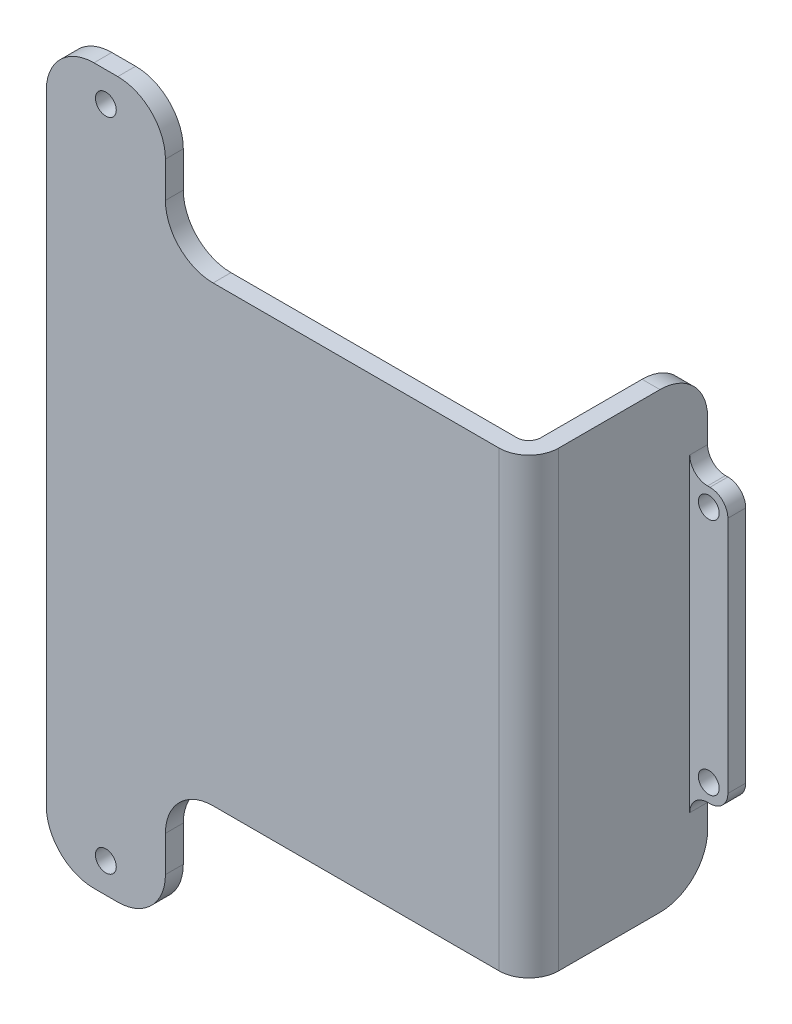
ISO-10303-21;
HEADER;
FILE_DESCRIPTION(('STEP AP214'),'2;1');
FILE_NAME('part.step','',(''),(''),'','','');
FILE_SCHEMA(('AUTOMOTIVE_DESIGN { 1 0 10303 214 1 1 1 1 }'));
ENDSEC;
DATA;
#1=APPLICATION_CONTEXT('core data for automotive mechanical design processes');
#2=APPLICATION_PROTOCOL_DEFINITION('international standard','automotive_design',2000,#1);
#3=PRODUCT_CONTEXT('',#1,'mechanical');
#4=PRODUCT('Part','Part','',(#3));
#5=PRODUCT_RELATED_PRODUCT_CATEGORY('part','',(#4));
#6=PRODUCT_DEFINITION_FORMATION('','',#4);
#7=PRODUCT_DEFINITION_CONTEXT('part definition',#1,'design');
#8=PRODUCT_DEFINITION('design','',#6,#7);
#9=PRODUCT_DEFINITION_SHAPE('','',#8);
#10=(LENGTH_UNIT() NAMED_UNIT(*) SI_UNIT(.MILLI.,.METRE.));
#11=(NAMED_UNIT(*) PLANE_ANGLE_UNIT() SI_UNIT($,.RADIAN.));
#12=(NAMED_UNIT(*) SI_UNIT($,.STERADIAN.) SOLID_ANGLE_UNIT());
#13=UNCERTAINTY_MEASURE_WITH_UNIT(LENGTH_MEASURE(1.E-05),#10,'distance_accuracy_value','');
#14=(GEOMETRIC_REPRESENTATION_CONTEXT(3) GLOBAL_UNCERTAINTY_ASSIGNED_CONTEXT((#13)) GLOBAL_UNIT_ASSIGNED_CONTEXT((#10,
#11,#12)) REPRESENTATION_CONTEXT('',''));
#15=CARTESIAN_POINT('',(0.,0.,0.));
#16=DIRECTION('',(0.,0.,1.));
#17=DIRECTION('',(1.,0.,0.));
#18=AXIS2_PLACEMENT_3D('',#15,#16,#17);
#19=CARTESIAN_POINT('',(0.,23.,-27.));
#20=DIRECTION('',(0.,1.,0.));
#21=DIRECTION('',(0.,0.,1.));
#22=AXIS2_PLACEMENT_3D('',#19,#20,#21);
#23=PLANE('',#22);
#24=DIRECTION('',(-1.,0.,0.));
#25=VECTOR('',#24,1.);
#26=CARTESIAN_POINT('',(0.,23.,-27.));
#27=LINE('',#26,#25);
#28=CARTESIAN_POINT('',(33.9,23.,-27.));
#29=VERTEX_POINT('',#28);
#30=CARTESIAN_POINT('',(33.5,23.,-27.));
#31=VERTEX_POINT('',#30);
#32=EDGE_CURVE('E253',#29,#31,#27,.T.);
#33=ORIENTED_EDGE('',*,*,#32,.T.);
#34=DIRECTION('',(0.,0.,1.));
#35=VECTOR('',#34,1.);
#36=CARTESIAN_POINT('',(33.5,23.,-24.));
#37=LINE('',#36,#35);
#38=CARTESIAN_POINT('',(33.5,23.,-24.));
#39=VERTEX_POINT('',#38);
#40=EDGE_CURVE('E410',#31,#39,#37,.T.);
#41=ORIENTED_EDGE('',*,*,#40,.T.);
#42=DIRECTION('',(-1.,0.,0.));
#43=VECTOR('',#42,1.);
#44=CARTESIAN_POINT('',(0.,23.,-24.));
#45=LINE('',#44,#43);
#46=CARTESIAN_POINT('',(33.9,23.,-24.));
#47=VERTEX_POINT('',#46);
#48=EDGE_CURVE('E279',#47,#39,#45,.T.);
#49=ORIENTED_EDGE('',*,*,#48,.F.);
#50=DIRECTION('',(0.,0.,1.));
#51=VECTOR('',#50,1.);
#52=CARTESIAN_POINT('',(33.9,23.,-27.));
#53=LINE('',#52,#51);
#54=EDGE_CURVE('E408',#47,#29,#53,.F.);
#55=ORIENTED_EDGE('',*,*,#54,.T.);
#56=EDGE_LOOP('',(#33,#41,#49,#55));
#57=FACE_BOUND('',#56,.T.);
#58=ADVANCED_FACE('F39',(#57),#23,.T.);
#59=CARTESIAN_POINT('',(36.9,0.,-27.));
#60=DIRECTION('',(-1.,0.,0.));
#61=DIRECTION('',(0.,0.,1.));
#62=AXIS2_PLACEMENT_3D('',#59,#60,#61);
#63=PLANE('',#62);
#64=DIRECTION('',(0.,-1.,0.));
#65=VECTOR('',#64,1.);
#66=CARTESIAN_POINT('',(36.9,0.,-27.));
#67=LINE('',#66,#65);
#68=CARTESIAN_POINT('',(36.9,20.,-27.));
#69=VERTEX_POINT('',#68);
#70=CARTESIAN_POINT('',(36.9,-20.,-27.));
#71=VERTEX_POINT('',#70);
#72=EDGE_CURVE('E260',#69,#71,#67,.T.);
#73=ORIENTED_EDGE('',*,*,#72,.F.);
#74=DIRECTION('',(0.,0.,1.));
#75=VECTOR('',#74,1.);
#76=CARTESIAN_POINT('',(36.9,20.,-24.));
#77=LINE('',#76,#75);
#78=CARTESIAN_POINT('',(36.9,20.,-24.));
#79=VERTEX_POINT('',#78);
#80=EDGE_CURVE('E418',#69,#79,#77,.T.);
#81=ORIENTED_EDGE('',*,*,#80,.T.);
#82=DIRECTION('',(0.,-1.,0.));
#83=VECTOR('',#82,1.);
#84=CARTESIAN_POINT('',(36.9,0.,-24.));
#85=LINE('',#84,#83);
#86=CARTESIAN_POINT('',(36.9,-20.,-24.));
#87=VERTEX_POINT('',#86);
#88=EDGE_CURVE('E282',#79,#87,#85,.T.);
#89=ORIENTED_EDGE('',*,*,#88,.T.);
#90=DIRECTION('',(0.,0.,1.));
#91=VECTOR('',#90,1.);
#92=CARTESIAN_POINT('',(36.9,-20.,-27.));
#93=LINE('',#92,#91);
#94=EDGE_CURVE('E416',#87,#71,#93,.F.);
#95=ORIENTED_EDGE('',*,*,#94,.T.);
#96=EDGE_LOOP('',(#73,#81,#89,#95));
#97=FACE_BOUND('',#96,.T.);
#98=ADVANCED_FACE('F434',(#97),#63,.F.);
#99=CARTESIAN_POINT('',(0.,-23.,-27.));
#100=DIRECTION('',(0.,1.,0.));
#101=DIRECTION('',(0.,0.,1.));
#102=AXIS2_PLACEMENT_3D('',#99,#100,#101);
#103=PLANE('',#102);
#104=DIRECTION('',(-1.,0.,0.));
#105=VECTOR('',#104,1.);
#106=CARTESIAN_POINT('',(0.,-23.,-27.));
#107=LINE('',#106,#105);
#108=CARTESIAN_POINT('',(33.9,-23.,-27.));
#109=VERTEX_POINT('',#108);
#110=CARTESIAN_POINT('',(33.5,-23.,-27.));
#111=VERTEX_POINT('',#110);
#112=EDGE_CURVE('E264',#109,#111,#107,.T.);
#113=ORIENTED_EDGE('',*,*,#112,.F.);
#114=DIRECTION('',(0.,0.,1.));
#115=VECTOR('',#114,1.);
#116=CARTESIAN_POINT('',(33.9,-23.,-27.));
#117=LINE('',#116,#115);
#118=CARTESIAN_POINT('',(33.9,-23.,-24.));
#119=VERTEX_POINT('',#118);
#120=EDGE_CURVE('E295',#109,#119,#117,.T.);
#121=ORIENTED_EDGE('',*,*,#120,.T.);
#122=DIRECTION('',(-1.,0.,0.));
#123=VECTOR('',#122,1.);
#124=CARTESIAN_POINT('',(0.,-23.,-24.));
#125=LINE('',#124,#123);
#126=CARTESIAN_POINT('',(33.5,-23.,-24.));
#127=VERTEX_POINT('',#126);
#128=EDGE_CURVE('E285',#119,#127,#125,.T.);
#129=ORIENTED_EDGE('',*,*,#128,.T.);
#130=DIRECTION('',(0.,0.,1.));
#131=VECTOR('',#130,1.);
#132=CARTESIAN_POINT('',(33.5,-23.,-27.));
#133=LINE('',#132,#131);
#134=EDGE_CURVE('E293',#127,#111,#133,.F.);
#135=ORIENTED_EDGE('',*,*,#134,.T.);
#136=EDGE_LOOP('',(#113,#121,#129,#135));
#137=FACE_BOUND('',#136,.T.);
#138=ADVANCED_FACE('F292',(#137),#103,.F.);
#139=CARTESIAN_POINT('',(33.7,20.,-27.));
#140=DIRECTION('',(0.,0.,1.));
#141=DIRECTION('',(1.,0.,0.));
#142=AXIS2_PLACEMENT_3D('',#139,#140,#141);
#143=CYLINDRICAL_SURFACE('',#142,1.75);
#144=CARTESIAN_POINT('',(33.7,20.,-27.));
#145=DIRECTION('',(0.,0.,1.));
#146=DIRECTION('',(1.,0.,0.));
#147=AXIS2_PLACEMENT_3D('',#144,#145,#146);
#148=CIRCLE('',#147,1.75);
#149=CARTESIAN_POINT('',(35.45,20.,-27.));
#150=VERTEX_POINT('',#149);
#151=EDGE_CURVE('E252',#150,#150,#148,.T.);
#152=ORIENTED_EDGE('',*,*,#151,.F.);
#153=EDGE_LOOP('',(#152));
#154=FACE_BOUND('',#153,.T.);
#155=CARTESIAN_POINT('',(33.7,20.,-24.));
#156=DIRECTION('',(0.,0.,1.));
#157=DIRECTION('',(1.,0.,0.));
#158=AXIS2_PLACEMENT_3D('',#155,#156,#157);
#159=CIRCLE('',#158,1.75);
#160=CARTESIAN_POINT('',(35.45,20.,-24.));
#161=VERTEX_POINT('',#160);
#162=EDGE_CURVE('E272',#161,#161,#159,.T.);
#163=ORIENTED_EDGE('',*,*,#162,.T.);
#164=EDGE_LOOP('',(#163));
#165=FACE_BOUND('',#164,.T.);
#166=ADVANCED_FACE('F527',(#154,#165),#143,.F.);
#167=CARTESIAN_POINT('',(33.7,-20.,-27.));
#168=DIRECTION('',(0.,0.,1.));
#169=DIRECTION('',(1.,0.,0.));
#170=AXIS2_PLACEMENT_3D('',#167,#168,#169);
#171=CYLINDRICAL_SURFACE('',#170,1.75);
#172=CARTESIAN_POINT('',(33.7,-20.,-27.));
#173=DIRECTION('',(0.,0.,1.));
#174=DIRECTION('',(1.,0.,0.));
#175=AXIS2_PLACEMENT_3D('',#172,#173,#174);
#176=CIRCLE('',#175,1.75);
#177=CARTESIAN_POINT('',(35.45,-20.,-27.));
#178=VERTEX_POINT('',#177);
#179=EDGE_CURVE('E257',#178,#178,#176,.F.);
#180=ORIENTED_EDGE('',*,*,#179,.T.);
#181=EDGE_LOOP('',(#180));
#182=FACE_BOUND('',#181,.T.);
#183=CARTESIAN_POINT('',(33.7,-20.,-24.));
#184=DIRECTION('',(0.,0.,1.));
#185=DIRECTION('',(1.,0.,0.));
#186=AXIS2_PLACEMENT_3D('',#183,#184,#185);
#187=CIRCLE('',#186,1.75);
#188=CARTESIAN_POINT('',(35.45,-20.,-24.));
#189=VERTEX_POINT('',#188);
#190=EDGE_CURVE('E268',#189,#189,#187,.F.);
#191=ORIENTED_EDGE('',*,*,#190,.F.);
#192=EDGE_LOOP('',(#191));
#193=FACE_BOUND('',#192,.T.);
#194=ADVANCED_FACE('F534',(#182,#193),#171,.F.);
#195=CARTESIAN_POINT('',(0.,-60.,3.));
#196=DIRECTION('',(0.,1.,0.));
#197=DIRECTION('',(0.,0.,1.));
#198=AXIS2_PLACEMENT_3D('',#195,#196,#197);
#199=PLANE('',#198);
#200=DIRECTION('',(1.,0.,0.));
#201=VECTOR('',#200,1.);
#202=CARTESIAN_POINT('',(0.,-60.,3.));
#203=LINE('',#202,#201);
#204=CARTESIAN_POINT('',(-42.5,-60.,3.));
#205=VERTEX_POINT('',#204);
#206=CARTESIAN_POINT('',(-38.5,-60.,3.));
#207=VERTEX_POINT('',#206);
#208=EDGE_CURVE('E463',#205,#207,#203,.T.);
#209=ORIENTED_EDGE('',*,*,#208,.F.);
#210=DIRECTION('',(0.,0.,-1.));
#211=VECTOR('',#210,1.);
#212=CARTESIAN_POINT('',(-42.5,-60.,3.));
#213=LINE('',#212,#211);
#214=CARTESIAN_POINT('',(-42.5,-60.,0.));
#215=VERTEX_POINT('',#214);
#216=EDGE_CURVE('E397',#205,#215,#213,.T.);
#217=ORIENTED_EDGE('',*,*,#216,.T.);
#218=DIRECTION('',(1.,0.,0.));
#219=VECTOR('',#218,1.);
#220=CARTESIAN_POINT('',(0.,-60.,0.));
#221=LINE('',#220,#219);
#222=CARTESIAN_POINT('',(-38.5,-60.,0.));
#223=VERTEX_POINT('',#222);
#224=EDGE_CURVE('E453',#215,#223,#221,.T.);
#225=ORIENTED_EDGE('',*,*,#224,.T.);
#226=DIRECTION('',(0.,0.,-1.));
#227=VECTOR('',#226,1.);
#228=CARTESIAN_POINT('',(-38.5,-60.,3.));
#229=LINE('',#228,#227);
#230=EDGE_CURVE('E395',#223,#207,#229,.F.);
#231=ORIENTED_EDGE('',*,*,#230,.T.);
#232=EDGE_LOOP('',(#209,#217,#225,#231));
#233=FACE_BOUND('',#232,.T.);
#234=ADVANCED_FACE('F539',(#233),#199,.F.);
#235=CARTESIAN_POINT('',(-30.5,0.,3.));
#236=DIRECTION('',(-1.,0.,0.));
#237=DIRECTION('',(0.,-1.,0.));
#238=AXIS2_PLACEMENT_3D('',#235,#236,#237);
#239=PLANE('',#238);
#240=DIRECTION('',(0.,1.,0.));
#241=VECTOR('',#240,1.);
#242=CARTESIAN_POINT('',(-30.5,0.,0.));
#243=LINE('',#242,#241);
#244=CARTESIAN_POINT('',(-30.5,-52.,0.));
#245=VERTEX_POINT('',#244);
#246=CARTESIAN_POINT('',(-30.5,-46.,0.));
#247=VERTEX_POINT('',#246);
#248=EDGE_CURVE('E457',#245,#247,#243,.T.);
#249=ORIENTED_EDGE('',*,*,#248,.T.);
#250=DIRECTION('',(0.,0.,-1.));
#251=VECTOR('',#250,1.);
#252=CARTESIAN_POINT('',(-30.5,-46.,3.));
#253=LINE('',#252,#251);
#254=CARTESIAN_POINT('',(-30.5,-46.,3.));
#255=VERTEX_POINT('',#254);
#256=EDGE_CURVE('E393',#247,#255,#253,.F.);
#257=ORIENTED_EDGE('',*,*,#256,.T.);
#258=DIRECTION('',(0.,1.,0.));
#259=VECTOR('',#258,1.);
#260=CARTESIAN_POINT('',(-30.5,0.,3.));
#261=LINE('',#260,#259);
#262=CARTESIAN_POINT('',(-30.5,-52.,3.));
#263=VERTEX_POINT('',#262);
#264=EDGE_CURVE('E466',#263,#255,#261,.T.);
#265=ORIENTED_EDGE('',*,*,#264,.F.);
#266=DIRECTION('',(0.,0.,-1.));
#267=VECTOR('',#266,1.);
#268=CARTESIAN_POINT('',(-30.5,-52.,3.));
#269=LINE('',#268,#267);
#270=EDGE_CURVE('E390',#263,#245,#269,.T.);
#271=ORIENTED_EDGE('',*,*,#270,.T.);
#272=EDGE_LOOP('',(#249,#257,#265,#271));
#273=FACE_BOUND('',#272,.T.);
#274=ADVANCED_FACE('F590',(#273),#239,.F.);
#275=CARTESIAN_POINT('',(0.,-38.,3.));
#276=DIRECTION('',(0.,1.,0.));
#277=DIRECTION('',(0.,0.,1.));
#278=AXIS2_PLACEMENT_3D('',#275,#276,#277);
#279=PLANE('',#278);
#280=DIRECTION('',(0.,0.,-1.));
#281=VECTOR('',#280,1.);
#282=CARTESIAN_POINT('',(30.5,-38.,3.));
#283=LINE('',#282,#281);
#284=CARTESIAN_POINT('',(30.5,-38.,-2.));
#285=VERTEX_POINT('',#284);
#286=CARTESIAN_POINT('',(30.5,-38.,-19.));
#287=VERTEX_POINT('',#286);
#288=EDGE_CURVE('E332',#285,#287,#283,.T.);
#289=ORIENTED_EDGE('',*,*,#288,.F.);
#290=CARTESIAN_POINT('',(25.5,-38.,-2.));
#291=DIRECTION('',(0.,1.,0.));
#292=DIRECTION('',(0.,0.,1.));
#293=AXIS2_PLACEMENT_3D('',#290,#291,#292);
#294=CIRCLE('',#293,5.);
#295=CARTESIAN_POINT('',(25.5,-38.,3.));
#296=VERTEX_POINT('',#295);
#297=EDGE_CURVE('E61',#285,#296,#294,.F.);
#298=ORIENTED_EDGE('',*,*,#297,.T.);
#299=DIRECTION('',(1.,0.,0.));
#300=VECTOR('',#299,1.);
#301=CARTESIAN_POINT('',(0.,-38.,3.));
#302=LINE('',#301,#300);
#303=CARTESIAN_POINT('',(-22.5,-38.,3.));
#304=VERTEX_POINT('',#303);
#305=EDGE_CURVE('E470',#304,#296,#302,.T.);
#306=ORIENTED_EDGE('',*,*,#305,.F.);
#307=DIRECTION('',(0.,0.,-1.));
#308=VECTOR('',#307,1.);
#309=CARTESIAN_POINT('',(-22.5,-38.,0.));
#310=LINE('',#309,#308);
#311=CARTESIAN_POINT('',(-22.5,-38.,0.));
#312=VERTEX_POINT('',#311);
#313=EDGE_CURVE('E355',#304,#312,#310,.T.);
#314=ORIENTED_EDGE('',*,*,#313,.T.);
#315=DIRECTION('',(1.,0.,0.));
#316=VECTOR('',#315,1.);
#317=CARTESIAN_POINT('',(0.,-38.,0.));
#318=LINE('',#317,#316);
#319=CARTESIAN_POINT('',(25.5,-38.,0.));
#320=VERTEX_POINT('',#319);
#321=EDGE_CURVE('E488',#312,#320,#318,.T.);
#322=ORIENTED_EDGE('',*,*,#321,.T.);
#323=CARTESIAN_POINT('',(25.5,-38.,-2.));
#324=DIRECTION('',(0.,1.,0.));
#325=DIRECTION('',(0.,0.,1.));
#326=AXIS2_PLACEMENT_3D('',#323,#324,#325);
#327=CIRCLE('',#326,2.);
#328=CARTESIAN_POINT('',(27.5,-38.,-2.));
#329=VERTEX_POINT('',#328);
#330=EDGE_CURVE('E324',#320,#329,#327,.T.);
#331=ORIENTED_EDGE('',*,*,#330,.T.);
#332=DIRECTION('',(0.,0.,1.));
#333=VECTOR('',#332,1.);
#334=CARTESIAN_POINT('',(27.5,-38.,-27.));
#335=LINE('',#334,#333);
#336=CARTESIAN_POINT('',(27.5,-38.,-19.));
#337=VERTEX_POINT('',#336);
#338=EDGE_CURVE('E450',#337,#329,#335,.T.);
#339=ORIENTED_EDGE('',*,*,#338,.F.);
#340=DIRECTION('',(1.,0.,0.));
#341=VECTOR('',#340,1.);
#342=CARTESIAN_POINT('',(0.,-38.,-19.));
#343=LINE('',#342,#341);
#344=EDGE_CURVE('E341',#337,#287,#343,.T.);
#345=ORIENTED_EDGE('',*,*,#344,.T.);
#346=EDGE_LOOP('',(#289,#298,#306,#314,#322,#331,#339,#345));
#347=FACE_BOUND('',#346,.T.);
#348=ADVANCED_FACE('F338',(#347),#279,.F.);
#349=CARTESIAN_POINT('',(30.5,0.,3.));
#350=DIRECTION('',(1.,0.,0.));
#351=DIRECTION('',(0.,0.,-1.));
#352=AXIS2_PLACEMENT_3D('',#349,#350,#351);
#353=PLANE('',#352);
#354=DIRECTION('',(0.,0.,-1.));
#355=VECTOR('',#354,1.);
#356=CARTESIAN_POINT('',(30.5,38.,3.));
#357=LINE('',#356,#355);
#358=CARTESIAN_POINT('',(30.5,38.,-2.));
#359=VERTEX_POINT('',#358);
#360=CARTESIAN_POINT('',(30.5,38.,-19.));
#361=VERTEX_POINT('',#360);
#362=EDGE_CURVE('E334',#359,#361,#357,.T.);
#363=ORIENTED_EDGE('',*,*,#362,.F.);
#364=DIRECTION('',(0.,-1.,0.));
#365=VECTOR('',#364,1.);
#366=CARTESIAN_POINT('',(30.5,0.,-2.));
#367=LINE('',#366,#365);
#368=EDGE_CURVE('E328',#359,#285,#367,.T.);
#369=ORIENTED_EDGE('',*,*,#368,.T.);
#370=ORIENTED_EDGE('',*,*,#288,.T.);
#371=CARTESIAN_POINT('',(30.5,-30.,-19.));
#372=DIRECTION('',(1.,0.,0.));
#373=DIRECTION('',(0.,0.,-1.));
#374=AXIS2_PLACEMENT_3D('',#371,#372,#373);
#375=CIRCLE('',#374,8.);
#376=CARTESIAN_POINT('',(30.5,-30.,-27.));
#377=VERTEX_POINT('',#376);
#378=EDGE_CURVE('E235',#287,#377,#375,.T.);
#379=ORIENTED_EDGE('',*,*,#378,.T.);
#380=DIRECTION('',(0.,-1.,0.));
#381=VECTOR('',#380,1.);
#382=CARTESIAN_POINT('',(30.5,0.,-27.));
#383=LINE('',#382,#381);
#384=CARTESIAN_POINT('',(30.5,-26.,-27.));
#385=VERTEX_POINT('',#384);
#386=EDGE_CURVE('E255',#385,#377,#383,.T.);
#387=ORIENTED_EDGE('',*,*,#386,.F.);
#388=DIRECTION('',(0.,0.,1.));
#389=VECTOR('',#388,1.);
#390=CARTESIAN_POINT('',(30.5,-26.,3.));
#391=LINE('',#390,#389);
#392=CARTESIAN_POINT('',(30.5,-26.,-24.));
#393=VERTEX_POINT('',#392);
#394=EDGE_CURVE('E413',#385,#393,#391,.T.);
#395=ORIENTED_EDGE('',*,*,#394,.T.);
#396=DIRECTION('',(0.,-1.,0.));
#397=VECTOR('',#396,1.);
#398=CARTESIAN_POINT('',(30.5,0.,-24.));
#399=LINE('',#398,#397);
#400=CARTESIAN_POINT('',(30.5,26.,-24.));
#401=VERTEX_POINT('',#400);
#402=EDGE_CURVE('E277',#401,#393,#399,.T.);
#403=ORIENTED_EDGE('',*,*,#402,.F.);
#404=DIRECTION('',(0.,0.,1.));
#405=VECTOR('',#404,1.);
#406=CARTESIAN_POINT('',(30.5,26.,-27.));
#407=LINE('',#406,#405);
#408=CARTESIAN_POINT('',(30.5,26.,-27.));
#409=VERTEX_POINT('',#408);
#410=EDGE_CURVE('E251',#401,#409,#407,.F.);
#411=ORIENTED_EDGE('',*,*,#410,.T.);
#412=CARTESIAN_POINT('',(30.5,30.,-27.));
#413=VERTEX_POINT('',#412);
#414=EDGE_CURVE('E243',#413,#409,#383,.T.);
#415=ORIENTED_EDGE('',*,*,#414,.F.);
#416=CARTESIAN_POINT('',(30.5,30.,-19.));
#417=DIRECTION('',(1.,0.,0.));
#418=DIRECTION('',(0.,0.,-1.));
#419=AXIS2_PLACEMENT_3D('',#416,#417,#418);
#420=CIRCLE('',#419,8.);
#421=EDGE_CURVE('E225',#413,#361,#420,.T.);
#422=ORIENTED_EDGE('',*,*,#421,.T.);
#423=EDGE_LOOP('',(#363,#369,#370,#379,#387,#395,#403,#411,#415,#422));
#424=FACE_BOUND('',#423,.T.);
#425=ADVANCED_FACE('F249',(#424),#353,.T.);
#426=CARTESIAN_POINT('',(0.,38.,3.));
#427=DIRECTION('',(0.,1.,0.));
#428=DIRECTION('',(0.,0.,1.));
#429=AXIS2_PLACEMENT_3D('',#426,#427,#428);
#430=PLANE('',#429);
#431=DIRECTION('',(1.,0.,0.));
#432=VECTOR('',#431,1.);
#433=CARTESIAN_POINT('',(0.,38.,3.));
#434=LINE('',#433,#432);
#435=CARTESIAN_POINT('',(-22.4999999999999,38.,3.));
#436=VERTEX_POINT('',#435);
#437=CARTESIAN_POINT('',(25.5,38.,3.));
#438=VERTEX_POINT('',#437);
#439=EDGE_CURVE('E473',#436,#438,#434,.T.);
#440=ORIENTED_EDGE('',*,*,#439,.T.);
#441=CARTESIAN_POINT('',(25.5,38.,-2.));
#442=DIRECTION('',(0.,1.,0.));
#443=DIRECTION('',(0.,0.,1.));
#444=AXIS2_PLACEMENT_3D('',#441,#442,#443);
#445=CIRCLE('',#444,5.);
#446=EDGE_CURVE('E11',#438,#359,#445,.T.);
#447=ORIENTED_EDGE('',*,*,#446,.T.);
#448=ORIENTED_EDGE('',*,*,#362,.T.);
#449=DIRECTION('',(1.,0.,0.));
#450=VECTOR('',#449,1.);
#451=CARTESIAN_POINT('',(27.5,38.,-19.));
#452=LINE('',#451,#450);
#453=CARTESIAN_POINT('',(27.5,38.,-19.));
#454=VERTEX_POINT('',#453);
#455=EDGE_CURVE('E230',#361,#454,#452,.F.);
#456=ORIENTED_EDGE('',*,*,#455,.T.);
#457=DIRECTION('',(0.,0.,1.));
#458=VECTOR('',#457,1.);
#459=CARTESIAN_POINT('',(27.5,38.,-27.));
#460=LINE('',#459,#458);
#461=CARTESIAN_POINT('',(27.5,38.,-2.));
#462=VERTEX_POINT('',#461);
#463=EDGE_CURVE('E454',#454,#462,#460,.T.);
#464=ORIENTED_EDGE('',*,*,#463,.T.);
#465=CARTESIAN_POINT('',(25.5,38.,-2.));
#466=DIRECTION('',(0.,1.,0.));
#467=DIRECTION('',(0.,0.,1.));
#468=AXIS2_PLACEMENT_3D('',#465,#466,#467);
#469=CIRCLE('',#468,2.);
#470=CARTESIAN_POINT('',(25.5,38.,0.));
#471=VERTEX_POINT('',#470);
#472=EDGE_CURVE('E326',#462,#471,#469,.F.);
#473=ORIENTED_EDGE('',*,*,#472,.T.);
#474=DIRECTION('',(1.,0.,0.));
#475=VECTOR('',#474,1.);
#476=CARTESIAN_POINT('',(0.,38.,0.));
#477=LINE('',#476,#475);
#478=CARTESIAN_POINT('',(-22.4999999999999,38.,0.));
#479=VERTEX_POINT('',#478);
#480=EDGE_CURVE('E491',#479,#471,#477,.T.);
#481=ORIENTED_EDGE('',*,*,#480,.F.);
#482=DIRECTION('',(0.,0.,-1.));
#483=VECTOR('',#482,1.);
#484=CARTESIAN_POINT('',(-22.4999999999999,38.,3.));
#485=LINE('',#484,#483);
#486=EDGE_CURVE('E234',#479,#436,#485,.F.);
#487=ORIENTED_EDGE('',*,*,#486,.T.);
#488=EDGE_LOOP('',(#440,#447,#448,#456,#464,#473,#481,#487));
#489=FACE_BOUND('',#488,.T.);
#490=ADVANCED_FACE('F602',(#489),#430,.T.);
#491=CARTESIAN_POINT('',(-30.4999999999999,46.,3.));
#492=VERTEX_POINT('',#491);
#493=CARTESIAN_POINT('',(-30.4999999999999,52.,3.));
#494=VERTEX_POINT('',#493);
#495=EDGE_CURVE('E471',#492,#494,#261,.T.);
#496=ORIENTED_EDGE('',*,*,#495,.F.);
#497=DIRECTION('',(0.,0.,-1.));
#498=VECTOR('',#497,1.);
#499=CARTESIAN_POINT('',(-30.4999999999999,46.,3.));
#500=LINE('',#499,#498);
#501=CARTESIAN_POINT('',(-30.4999999999999,46.,0.));
#502=VERTEX_POINT('',#501);
#503=EDGE_CURVE('E361',#492,#502,#500,.T.);
#504=ORIENTED_EDGE('',*,*,#503,.T.);
#505=CARTESIAN_POINT('',(-30.4999999999999,52.,0.));
#506=VERTEX_POINT('',#505);
#507=EDGE_CURVE('E489',#502,#506,#243,.T.);
#508=ORIENTED_EDGE('',*,*,#507,.T.);
#509=DIRECTION('',(0.,0.,-1.));
#510=VECTOR('',#509,1.);
#511=CARTESIAN_POINT('',(-30.4999999999999,52.,3.));
#512=LINE('',#511,#510);
#513=EDGE_CURVE('E359',#506,#494,#512,.F.);
#514=ORIENTED_EDGE('',*,*,#513,.T.);
#515=EDGE_LOOP('',(#496,#504,#508,#514));
#516=FACE_BOUND('',#515,.T.);
#517=ADVANCED_FACE('F613',(#516),#239,.F.);
#518=CARTESIAN_POINT('',(0.,60.,3.));
#519=DIRECTION('',(0.,1.,0.));
#520=DIRECTION('',(0.,0.,1.));
#521=AXIS2_PLACEMENT_3D('',#518,#519,#520);
#522=PLANE('',#521);
#523=DIRECTION('',(1.,0.,0.));
#524=VECTOR('',#523,1.);
#525=CARTESIAN_POINT('',(0.,60.,3.));
#526=LINE('',#525,#524);
#527=CARTESIAN_POINT('',(-42.5,60.,3.));
#528=VERTEX_POINT('',#527);
#529=CARTESIAN_POINT('',(-38.4999999999999,60.,3.));
#530=VERTEX_POINT('',#529);
#531=EDGE_CURVE('E475',#528,#530,#526,.T.);
#532=ORIENTED_EDGE('',*,*,#531,.T.);
#533=DIRECTION('',(0.,0.,-1.));
#534=VECTOR('',#533,1.);
#535=CARTESIAN_POINT('',(-38.4999999999999,60.,0.));
#536=LINE('',#535,#534);
#537=CARTESIAN_POINT('',(-38.4999999999999,60.,0.));
#538=VERTEX_POINT('',#537);
#539=EDGE_CURVE('E366',#530,#538,#536,.T.);
#540=ORIENTED_EDGE('',*,*,#539,.T.);
#541=DIRECTION('',(1.,0.,0.));
#542=VECTOR('',#541,1.);
#543=CARTESIAN_POINT('',(0.,60.,0.));
#544=LINE('',#543,#542);
#545=CARTESIAN_POINT('',(-42.5,60.,0.));
#546=VERTEX_POINT('',#545);
#547=EDGE_CURVE('E494',#546,#538,#544,.T.);
#548=ORIENTED_EDGE('',*,*,#547,.F.);
#549=DIRECTION('',(0.,0.,-1.));
#550=VECTOR('',#549,1.);
#551=CARTESIAN_POINT('',(-42.5,60.,3.));
#552=LINE('',#551,#550);
#553=EDGE_CURVE('E364',#546,#528,#552,.F.);
#554=ORIENTED_EDGE('',*,*,#553,.T.);
#555=EDGE_LOOP('',(#532,#540,#548,#554));
#556=FACE_BOUND('',#555,.T.);
#557=ADVANCED_FACE('F814',(#556),#522,.T.);
#558=CARTESIAN_POINT('',(-40.5,-55.,3.));
#559=DIRECTION('',(0.,0.,-1.));
#560=DIRECTION('',(-1.,0.,0.));
#561=AXIS2_PLACEMENT_3D('',#558,#559,#560);
#562=CYLINDRICAL_SURFACE('',#561,1.75);
#563=CARTESIAN_POINT('',(-40.5,-55.,3.));
#564=DIRECTION('',(0.,0.,1.));
#565=DIRECTION('',(1.,0.,0.));
#566=AXIS2_PLACEMENT_3D('',#563,#564,#565);
#567=CIRCLE('',#566,1.75);
#568=CARTESIAN_POINT('',(-38.75,-55.,3.));
#569=VERTEX_POINT('',#568);
#570=EDGE_CURVE('E481',#569,#569,#567,.T.);
#571=ORIENTED_EDGE('',*,*,#570,.T.);
#572=EDGE_LOOP('',(#571));
#573=FACE_BOUND('',#572,.T.);
#574=CARTESIAN_POINT('',(-40.5,-55.,0.));
#575=DIRECTION('',(0.,0.,1.));
#576=DIRECTION('',(1.,0.,0.));
#577=AXIS2_PLACEMENT_3D('',#574,#575,#576);
#578=CIRCLE('',#577,1.75);
#579=CARTESIAN_POINT('',(-38.75,-55.,0.));
#580=VERTEX_POINT('',#579);
#581=EDGE_CURVE('E500',#580,#580,#578,.T.);
#582=ORIENTED_EDGE('',*,*,#581,.F.);
#583=EDGE_LOOP('',(#582));
#584=FACE_BOUND('',#583,.T.);
#585=ADVANCED_FACE('F804',(#573,#584),#562,.F.);
#586=CARTESIAN_POINT('',(-50.5,0.,3.));
#587=DIRECTION('',(1.,0.,0.));
#588=DIRECTION('',(0.,0.,-1.));
#589=AXIS2_PLACEMENT_3D('',#586,#587,#588);
#590=PLANE('',#589);
#591=DIRECTION('',(0.,-1.,0.));
#592=VECTOR('',#591,1.);
#593=CARTESIAN_POINT('',(-50.5,0.,3.));
#594=LINE('',#593,#592);
#595=CARTESIAN_POINT('',(-50.5,52.,3.));
#596=VERTEX_POINT('',#595);
#597=CARTESIAN_POINT('',(-50.5,-52.,3.));
#598=VERTEX_POINT('',#597);
#599=EDGE_CURVE('E478',#596,#598,#594,.T.);
#600=ORIENTED_EDGE('',*,*,#599,.F.);
#601=DIRECTION('',(0.,0.,-1.));
#602=VECTOR('',#601,1.);
#603=CARTESIAN_POINT('',(-50.5,52.,0.));
#604=LINE('',#603,#602);
#605=CARTESIAN_POINT('',(-50.5,52.,0.));
#606=VERTEX_POINT('',#605);
#607=EDGE_CURVE('E387',#596,#606,#604,.T.);
#608=ORIENTED_EDGE('',*,*,#607,.T.);
#609=DIRECTION('',(0.,-1.,0.));
#610=VECTOR('',#609,1.);
#611=CARTESIAN_POINT('',(-50.5,0.,0.));
#612=LINE('',#611,#610);
#613=CARTESIAN_POINT('',(-50.5,-52.,0.));
#614=VERTEX_POINT('',#613);
#615=EDGE_CURVE('E497',#606,#614,#612,.T.);
#616=ORIENTED_EDGE('',*,*,#615,.T.);
#617=DIRECTION('',(0.,0.,-1.));
#618=VECTOR('',#617,1.);
#619=CARTESIAN_POINT('',(-50.5,-52.,3.));
#620=LINE('',#619,#618);
#621=EDGE_CURVE('E385',#614,#598,#620,.F.);
#622=ORIENTED_EDGE('',*,*,#621,.T.);
#623=EDGE_LOOP('',(#600,#608,#616,#622));
#624=FACE_BOUND('',#623,.T.);
#625=ADVANCED_FACE('F796',(#624),#590,.F.);
#626=CARTESIAN_POINT('',(-40.5,55.,3.));
#627=DIRECTION('',(0.,0.,-1.));
#628=DIRECTION('',(-1.,0.,0.));
#629=AXIS2_PLACEMENT_3D('',#626,#627,#628);
#630=CYLINDRICAL_SURFACE('',#629,1.75);
#631=CARTESIAN_POINT('',(-40.5,55.,3.));
#632=DIRECTION('',(0.,0.,1.));
#633=DIRECTION('',(1.,0.,0.));
#634=AXIS2_PLACEMENT_3D('',#631,#632,#633);
#635=CIRCLE('',#634,1.75);
#636=CARTESIAN_POINT('',(-38.75,55.,3.));
#637=VERTEX_POINT('',#636);
#638=EDGE_CURVE('E344',#637,#637,#635,.F.);
#639=ORIENTED_EDGE('',*,*,#638,.F.);
#640=EDGE_LOOP('',(#639));
#641=FACE_BOUND('',#640,.T.);
#642=CARTESIAN_POINT('',(-40.5,55.,0.));
#643=DIRECTION('',(0.,0.,1.));
#644=DIRECTION('',(1.,0.,0.));
#645=AXIS2_PLACEMENT_3D('',#642,#643,#644);
#646=CIRCLE('',#645,1.75);
#647=CARTESIAN_POINT('',(-38.75,55.,0.));
#648=VERTEX_POINT('',#647);
#649=EDGE_CURVE('E467',#648,#648,#646,.F.);
#650=ORIENTED_EDGE('',*,*,#649,.T.);
#651=EDGE_LOOP('',(#650));
#652=FACE_BOUND('',#651,.T.);
#653=ADVANCED_FACE('F505',(#641,#652),#630,.F.);
#654=CARTESIAN_POINT('',(0.,0.,3.));
#655=DIRECTION('',(0.,0.,1.));
#656=DIRECTION('',(1.,0.,0.));
#657=AXIS2_PLACEMENT_3D('',#654,#655,#656);
#658=PLANE('',#657);
#659=ORIENTED_EDGE('',*,*,#305,.T.);
#660=DIRECTION('',(0.,-1.,0.));
#661=VECTOR('',#660,1.);
#662=CARTESIAN_POINT('',(25.5,0.,3.));
#663=LINE('',#662,#661);
#664=EDGE_CURVE('E47',#296,#438,#663,.F.);
#665=ORIENTED_EDGE('',*,*,#664,.T.);
#666=ORIENTED_EDGE('',*,*,#439,.F.);
#667=CARTESIAN_POINT('',(-22.4999999999999,46.,3.));
#668=DIRECTION('',(0.,0.,1.));
#669=DIRECTION('',(1.,0.,0.));
#670=AXIS2_PLACEMENT_3D('',#667,#668,#669);
#671=CIRCLE('',#670,8.);
#672=EDGE_CURVE('E402',#436,#492,#671,.F.);
#673=ORIENTED_EDGE('',*,*,#672,.T.);
#674=ORIENTED_EDGE('',*,*,#495,.T.);
#675=CARTESIAN_POINT('',(-38.4999999999999,52.,3.));
#676=DIRECTION('',(0.,0.,1.));
#677=DIRECTION('',(1.,0.,0.));
#678=AXIS2_PLACEMENT_3D('',#675,#676,#677);
#679=CIRCLE('',#678,8.);
#680=EDGE_CURVE('E383',#494,#530,#679,.T.);
#681=ORIENTED_EDGE('',*,*,#680,.T.);
#682=ORIENTED_EDGE('',*,*,#531,.F.);
#683=CARTESIAN_POINT('',(-42.5,52.,3.));
#684=DIRECTION('',(0.,0.,1.));
#685=DIRECTION('',(1.,0.,0.));
#686=AXIS2_PLACEMENT_3D('',#683,#684,#685);
#687=CIRCLE('',#686,8.);
#688=EDGE_CURVE('E381',#528,#596,#687,.T.);
#689=ORIENTED_EDGE('',*,*,#688,.T.);
#690=ORIENTED_EDGE('',*,*,#599,.T.);
#691=CARTESIAN_POINT('',(-42.5,-52.,3.));
#692=DIRECTION('',(0.,0.,1.));
#693=DIRECTION('',(1.,0.,0.));
#694=AXIS2_PLACEMENT_3D('',#691,#692,#693);
#695=CIRCLE('',#694,8.);
#696=EDGE_CURVE('E379',#598,#205,#695,.T.);
#697=ORIENTED_EDGE('',*,*,#696,.T.);
#698=ORIENTED_EDGE('',*,*,#208,.T.);
#699=CARTESIAN_POINT('',(-38.5,-52.,3.));
#700=DIRECTION('',(0.,0.,1.));
#701=DIRECTION('',(1.,0.,0.));
#702=AXIS2_PLACEMENT_3D('',#699,#700,#701);
#703=CIRCLE('',#702,8.);
#704=EDGE_CURVE('E377',#207,#263,#703,.T.);
#705=ORIENTED_EDGE('',*,*,#704,.T.);
#706=ORIENTED_EDGE('',*,*,#264,.T.);
#707=CARTESIAN_POINT('',(-22.5,-46.,3.));
#708=DIRECTION('',(0.,0.,1.));
#709=DIRECTION('',(1.,0.,0.));
#710=AXIS2_PLACEMENT_3D('',#707,#708,#709);
#711=CIRCLE('',#710,8.);
#712=EDGE_CURVE('E406',#255,#304,#711,.F.);
#713=ORIENTED_EDGE('',*,*,#712,.T.);
#714=EDGE_LOOP('',(#659,#665,#666,#673,#674,#681,#682,#689,#690,#697,#698,#705,#706,#713));
#715=FACE_BOUND('',#714,.T.);
#716=ORIENTED_EDGE('',*,*,#570,.F.);
#717=EDGE_LOOP('',(#716));
#718=FACE_BOUND('',#717,.T.);
#719=ORIENTED_EDGE('',*,*,#638,.T.);
#720=EDGE_LOOP('',(#719));
#721=FACE_BOUND('',#720,.T.);
#722=ADVANCED_FACE('F509',(#715,#718,#721),#658,.T.);
#723=CARTESIAN_POINT('',(0.,0.,0.));
#724=DIRECTION('',(0.,0.,1.));
#725=DIRECTION('',(1.,0.,0.));
#726=AXIS2_PLACEMENT_3D('',#723,#724,#725);
#727=PLANE('',#726);
#728=ORIENTED_EDGE('',*,*,#480,.T.);
#729=DIRECTION('',(0.,-1.,0.));
#730=VECTOR('',#729,1.);
#731=CARTESIAN_POINT('',(25.5,0.,0.));
#732=LINE('',#731,#730);
#733=EDGE_CURVE('E319',#471,#320,#732,.T.);
#734=ORIENTED_EDGE('',*,*,#733,.T.);
#735=ORIENTED_EDGE('',*,*,#321,.F.);
#736=CARTESIAN_POINT('',(-22.5,-46.,0.));
#737=DIRECTION('',(0.,0.,1.));
#738=DIRECTION('',(1.,0.,0.));
#739=AXIS2_PLACEMENT_3D('',#736,#737,#738);
#740=CIRCLE('',#739,8.);
#741=EDGE_CURVE('E404',#312,#247,#740,.T.);
#742=ORIENTED_EDGE('',*,*,#741,.T.);
#743=ORIENTED_EDGE('',*,*,#248,.F.);
#744=CARTESIAN_POINT('',(-38.5,-52.,0.));
#745=DIRECTION('',(0.,0.,1.));
#746=DIRECTION('',(1.,0.,0.));
#747=AXIS2_PLACEMENT_3D('',#744,#745,#746);
#748=CIRCLE('',#747,8.);
#749=EDGE_CURVE('E369',#245,#223,#748,.F.);
#750=ORIENTED_EDGE('',*,*,#749,.T.);
#751=ORIENTED_EDGE('',*,*,#224,.F.);
#752=CARTESIAN_POINT('',(-42.5,-52.,0.));
#753=DIRECTION('',(0.,0.,1.));
#754=DIRECTION('',(1.,0.,0.));
#755=AXIS2_PLACEMENT_3D('',#752,#753,#754);
#756=CIRCLE('',#755,8.);
#757=EDGE_CURVE('E371',#215,#614,#756,.F.);
#758=ORIENTED_EDGE('',*,*,#757,.T.);
#759=ORIENTED_EDGE('',*,*,#615,.F.);
#760=CARTESIAN_POINT('',(-42.5,52.,0.));
#761=DIRECTION('',(0.,0.,1.));
#762=DIRECTION('',(1.,0.,0.));
#763=AXIS2_PLACEMENT_3D('',#760,#761,#762);
#764=CIRCLE('',#763,8.);
#765=EDGE_CURVE('E373',#606,#546,#764,.F.);
#766=ORIENTED_EDGE('',*,*,#765,.T.);
#767=ORIENTED_EDGE('',*,*,#547,.T.);
#768=CARTESIAN_POINT('',(-38.4999999999999,52.,0.));
#769=DIRECTION('',(0.,0.,1.));
#770=DIRECTION('',(1.,0.,0.));
#771=AXIS2_PLACEMENT_3D('',#768,#769,#770);
#772=CIRCLE('',#771,8.);
#773=EDGE_CURVE('E375',#538,#506,#772,.F.);
#774=ORIENTED_EDGE('',*,*,#773,.T.);
#775=ORIENTED_EDGE('',*,*,#507,.F.);
#776=CARTESIAN_POINT('',(-22.4999999999999,46.,0.));
#777=DIRECTION('',(0.,0.,1.));
#778=DIRECTION('',(1.,0.,0.));
#779=AXIS2_PLACEMENT_3D('',#776,#777,#778);
#780=CIRCLE('',#779,8.);
#781=EDGE_CURVE('E400',#502,#479,#780,.T.);
#782=ORIENTED_EDGE('',*,*,#781,.T.);
#783=EDGE_LOOP('',(#728,#734,#735,#742,#743,#750,#751,#758,#759,#766,#767,#774,#775,#782));
#784=FACE_BOUND('',#783,.T.);
#785=ORIENTED_EDGE('',*,*,#581,.T.);
#786=EDGE_LOOP('',(#785));
#787=FACE_BOUND('',#786,.T.);
#788=ORIENTED_EDGE('',*,*,#649,.F.);
#789=EDGE_LOOP('',(#788));
#790=FACE_BOUND('',#789,.T.);
#791=ADVANCED_FACE('F507',(#784,#787,#790),#727,.F.);
#792=CARTESIAN_POINT('',(27.5,0.,-27.));
#793=DIRECTION('',(-1.,0.,0.));
#794=DIRECTION('',(0.,0.,1.));
#795=AXIS2_PLACEMENT_3D('',#792,#793,#794);
#796=PLANE('',#795);
#797=ORIENTED_EDGE('',*,*,#338,.T.);
#798=DIRECTION('',(0.,-1.,0.));
#799=VECTOR('',#798,1.);
#800=CARTESIAN_POINT('',(27.5,0.,-2.));
#801=LINE('',#800,#799);
#802=EDGE_CURVE('E322',#329,#462,#801,.F.);
#803=ORIENTED_EDGE('',*,*,#802,.T.);
#804=ORIENTED_EDGE('',*,*,#463,.F.);
#805=CARTESIAN_POINT('',(27.5,30.,-19.));
#806=DIRECTION('',(-1.,0.,0.));
#807=DIRECTION('',(0.,0.,1.));
#808=AXIS2_PLACEMENT_3D('',#805,#806,#807);
#809=CIRCLE('',#808,8.);
#810=CARTESIAN_POINT('',(27.5,30.,-27.));
#811=VERTEX_POINT('',#810);
#812=EDGE_CURVE('E353',#454,#811,#809,.T.);
#813=ORIENTED_EDGE('',*,*,#812,.T.);
#814=DIRECTION('',(0.,-1.,0.));
#815=VECTOR('',#814,1.);
#816=CARTESIAN_POINT('',(27.5,0.,-27.));
#817=LINE('',#816,#815);
#818=CARTESIAN_POINT('',(27.5,-30.,-27.));
#819=VERTEX_POINT('',#818);
#820=EDGE_CURVE('E246',#811,#819,#817,.T.);
#821=ORIENTED_EDGE('',*,*,#820,.T.);
#822=CARTESIAN_POINT('',(27.5,-30.,-19.));
#823=DIRECTION('',(-1.,0.,0.));
#824=DIRECTION('',(0.,0.,1.));
#825=AXIS2_PLACEMENT_3D('',#822,#823,#824);
#826=CIRCLE('',#825,8.);
#827=EDGE_CURVE('E351',#819,#337,#826,.T.);
#828=ORIENTED_EDGE('',*,*,#827,.T.);
#829=EDGE_LOOP('',(#797,#803,#804,#813,#821,#828));
#830=FACE_BOUND('',#829,.T.);
#831=ADVANCED_FACE('F449',(#830),#796,.T.);
#832=CARTESIAN_POINT('',(0.,0.,-27.));
#833=DIRECTION('',(0.,0.,1.));
#834=DIRECTION('',(1.,0.,0.));
#835=AXIS2_PLACEMENT_3D('',#832,#833,#834);
#836=PLANE('',#835);
#837=ORIENTED_EDGE('',*,*,#32,.F.);
#838=CARTESIAN_POINT('',(33.9,20.,-27.));
#839=DIRECTION('',(0.,0.,1.));
#840=DIRECTION('',(1.,0.,0.));
#841=AXIS2_PLACEMENT_3D('',#838,#839,#840);
#842=CIRCLE('',#841,3.);
#843=EDGE_CURVE('E305',#29,#69,#842,.F.);
#844=ORIENTED_EDGE('',*,*,#843,.T.);
#845=ORIENTED_EDGE('',*,*,#72,.T.);
#846=CARTESIAN_POINT('',(33.9,-20.,-27.));
#847=DIRECTION('',(0.,0.,1.));
#848=DIRECTION('',(1.,0.,0.));
#849=AXIS2_PLACEMENT_3D('',#846,#847,#848);
#850=CIRCLE('',#849,3.);
#851=EDGE_CURVE('E309',#71,#109,#850,.F.);
#852=ORIENTED_EDGE('',*,*,#851,.T.);
#853=ORIENTED_EDGE('',*,*,#112,.T.);
#854=CARTESIAN_POINT('',(33.5,-26.,-27.));
#855=DIRECTION('',(0.,0.,1.));
#856=DIRECTION('',(1.,0.,0.));
#857=AXIS2_PLACEMENT_3D('',#854,#855,#856);
#858=CIRCLE('',#857,3.);
#859=EDGE_CURVE('E304',#111,#385,#858,.T.);
#860=ORIENTED_EDGE('',*,*,#859,.T.);
#861=ORIENTED_EDGE('',*,*,#386,.T.);
#862=DIRECTION('',(1.,0.,0.));
#863=VECTOR('',#862,1.);
#864=CARTESIAN_POINT('',(0.,-30.,-27.));
#865=LINE('',#864,#863);
#866=EDGE_CURVE('E247',#377,#819,#865,.F.);
#867=ORIENTED_EDGE('',*,*,#866,.T.);
#868=ORIENTED_EDGE('',*,*,#820,.F.);
#869=DIRECTION('',(1.,0.,0.));
#870=VECTOR('',#869,1.);
#871=CARTESIAN_POINT('',(30.5,30.,-27.));
#872=LINE('',#871,#870);
#873=EDGE_CURVE('E229',#811,#413,#872,.T.);
#874=ORIENTED_EDGE('',*,*,#873,.T.);
#875=ORIENTED_EDGE('',*,*,#414,.T.);
#876=CARTESIAN_POINT('',(33.5,26.,-27.));
#877=DIRECTION('',(0.,0.,1.));
#878=DIRECTION('',(1.,0.,0.));
#879=AXIS2_PLACEMENT_3D('',#876,#877,#878);
#880=CIRCLE('',#879,3.);
#881=EDGE_CURVE('E315',#409,#31,#880,.T.);
#882=ORIENTED_EDGE('',*,*,#881,.T.);
#883=EDGE_LOOP('',(#837,#844,#845,#852,#853,#860,#861,#867,#868,#874,#875,#882));
#884=FACE_BOUND('',#883,.T.);
#885=ORIENTED_EDGE('',*,*,#151,.T.);
#886=EDGE_LOOP('',(#885));
#887=FACE_BOUND('',#886,.T.);
#888=ORIENTED_EDGE('',*,*,#179,.F.);
#889=EDGE_LOOP('',(#888));
#890=FACE_BOUND('',#889,.T.);
#891=ADVANCED_FACE('F241',(#884,#887,#890),#836,.F.);
#892=CARTESIAN_POINT('',(0.,0.,-24.));
#893=DIRECTION('',(0.,0.,1.));
#894=DIRECTION('',(1.,0.,0.));
#895=AXIS2_PLACEMENT_3D('',#892,#893,#894);
#896=PLANE('',#895);
#897=ORIENTED_EDGE('',*,*,#88,.F.);
#898=CARTESIAN_POINT('',(33.9,20.,-24.));
#899=DIRECTION('',(0.,0.,1.));
#900=DIRECTION('',(1.,0.,0.));
#901=AXIS2_PLACEMENT_3D('',#898,#899,#900);
#902=CIRCLE('',#901,3.);
#903=EDGE_CURVE('E423',#79,#47,#902,.T.);
#904=ORIENTED_EDGE('',*,*,#903,.T.);
#905=ORIENTED_EDGE('',*,*,#48,.T.);
#906=CARTESIAN_POINT('',(33.5,26.,-24.));
#907=DIRECTION('',(0.,0.,1.));
#908=DIRECTION('',(1.,0.,0.));
#909=AXIS2_PLACEMENT_3D('',#906,#907,#908);
#910=CIRCLE('',#909,3.);
#911=EDGE_CURVE('E307',#39,#401,#910,.F.);
#912=ORIENTED_EDGE('',*,*,#911,.T.);
#913=ORIENTED_EDGE('',*,*,#402,.T.);
#914=CARTESIAN_POINT('',(33.5,-26.,-24.));
#915=DIRECTION('',(0.,0.,1.));
#916=DIRECTION('',(1.,0.,0.));
#917=AXIS2_PLACEMENT_3D('',#914,#915,#916);
#918=CIRCLE('',#917,3.);
#919=EDGE_CURVE('E302',#393,#127,#918,.F.);
#920=ORIENTED_EDGE('',*,*,#919,.T.);
#921=ORIENTED_EDGE('',*,*,#128,.F.);
#922=CARTESIAN_POINT('',(33.9,-20.,-24.));
#923=DIRECTION('',(0.,0.,1.));
#924=DIRECTION('',(1.,0.,0.));
#925=AXIS2_PLACEMENT_3D('',#922,#923,#924);
#926=CIRCLE('',#925,3.);
#927=EDGE_CURVE('E421',#119,#87,#926,.T.);
#928=ORIENTED_EDGE('',*,*,#927,.T.);
#929=EDGE_LOOP('',(#897,#904,#905,#912,#913,#920,#921,#928));
#930=FACE_BOUND('',#929,.T.);
#931=ORIENTED_EDGE('',*,*,#162,.F.);
#932=EDGE_LOOP('',(#931));
#933=FACE_BOUND('',#932,.T.);
#934=ORIENTED_EDGE('',*,*,#190,.T.);
#935=EDGE_LOOP('',(#934));
#936=FACE_BOUND('',#935,.T.);
#937=ADVANCED_FACE('F431',(#930,#933,#936),#896,.T.);
#938=CARTESIAN_POINT('',(0.,30.,-19.));
#939=DIRECTION('',(-1.,0.,0.));
#940=DIRECTION('',(0.,0.,1.));
#941=AXIS2_PLACEMENT_3D('',#938,#939,#940);
#942=CYLINDRICAL_SURFACE('',#941,8.);
#943=ORIENTED_EDGE('',*,*,#812,.F.);
#944=ORIENTED_EDGE('',*,*,#455,.F.);
#945=ORIENTED_EDGE('',*,*,#421,.F.);
#946=ORIENTED_EDGE('',*,*,#873,.F.);
#947=EDGE_LOOP('',(#943,#944,#945,#946));
#948=FACE_BOUND('',#947,.T.);
#949=ADVANCED_FACE('F228',(#948),#942,.T.);
#950=CARTESIAN_POINT('',(0.,-30.,-19.));
#951=DIRECTION('',(1.,0.,0.));
#952=DIRECTION('',(0.,0.,-1.));
#953=AXIS2_PLACEMENT_3D('',#950,#951,#952);
#954=CYLINDRICAL_SURFACE('',#953,8.);
#955=ORIENTED_EDGE('',*,*,#827,.F.);
#956=ORIENTED_EDGE('',*,*,#866,.F.);
#957=ORIENTED_EDGE('',*,*,#378,.F.);
#958=ORIENTED_EDGE('',*,*,#344,.F.);
#959=EDGE_LOOP('',(#955,#956,#957,#958));
#960=FACE_BOUND('',#959,.T.);
#961=ADVANCED_FACE('F447',(#960),#954,.T.);
#962=CARTESIAN_POINT('',(-22.4999999999999,46.,3.));
#963=DIRECTION('',(0.,0.,-1.));
#964=DIRECTION('',(-1.,0.,0.));
#965=AXIS2_PLACEMENT_3D('',#962,#963,#964);
#966=CYLINDRICAL_SURFACE('',#965,8.);
#967=ORIENTED_EDGE('',*,*,#672,.F.);
#968=ORIENTED_EDGE('',*,*,#486,.F.);
#969=ORIENTED_EDGE('',*,*,#781,.F.);
#970=ORIENTED_EDGE('',*,*,#503,.F.);
#971=EDGE_LOOP('',(#967,#968,#969,#970));
#972=FACE_BOUND('',#971,.T.);
#973=ADVANCED_FACE('F712',(#972),#966,.F.);
#974=CARTESIAN_POINT('',(-38.4999999999999,52.,3.));
#975=DIRECTION('',(0.,0.,1.));
#976=DIRECTION('',(1.,0.,0.));
#977=AXIS2_PLACEMENT_3D('',#974,#975,#976);
#978=CYLINDRICAL_SURFACE('',#977,8.);
#979=ORIENTED_EDGE('',*,*,#680,.F.);
#980=ORIENTED_EDGE('',*,*,#513,.F.);
#981=ORIENTED_EDGE('',*,*,#773,.F.);
#982=ORIENTED_EDGE('',*,*,#539,.F.);
#983=EDGE_LOOP('',(#979,#980,#981,#982));
#984=FACE_BOUND('',#983,.T.);
#985=ADVANCED_FACE('F702',(#984),#978,.T.);
#986=CARTESIAN_POINT('',(-42.5,52.,3.));
#987=DIRECTION('',(0.,0.,1.));
#988=DIRECTION('',(1.,0.,0.));
#989=AXIS2_PLACEMENT_3D('',#986,#987,#988);
#990=CYLINDRICAL_SURFACE('',#989,8.);
#991=ORIENTED_EDGE('',*,*,#688,.F.);
#992=ORIENTED_EDGE('',*,*,#553,.F.);
#993=ORIENTED_EDGE('',*,*,#765,.F.);
#994=ORIENTED_EDGE('',*,*,#607,.F.);
#995=EDGE_LOOP('',(#991,#992,#993,#994));
#996=FACE_BOUND('',#995,.T.);
#997=ADVANCED_FACE('F692',(#996),#990,.T.);
#998=CARTESIAN_POINT('',(-22.5,-46.,3.));
#999=DIRECTION('',(0.,0.,1.));
#1000=DIRECTION('',(1.,0.,0.));
#1001=AXIS2_PLACEMENT_3D('',#998,#999,#1000);
#1002=CYLINDRICAL_SURFACE('',#1001,8.);
#1003=ORIENTED_EDGE('',*,*,#712,.F.);
#1004=ORIENTED_EDGE('',*,*,#256,.F.);
#1005=ORIENTED_EDGE('',*,*,#741,.F.);
#1006=ORIENTED_EDGE('',*,*,#313,.F.);
#1007=EDGE_LOOP('',(#1003,#1004,#1005,#1006));
#1008=FACE_BOUND('',#1007,.T.);
#1009=ADVANCED_FACE('F682',(#1008),#1002,.F.);
#1010=CARTESIAN_POINT('',(-42.5,-52.,3.));
#1011=DIRECTION('',(0.,0.,-1.));
#1012=DIRECTION('',(-1.,0.,0.));
#1013=AXIS2_PLACEMENT_3D('',#1010,#1011,#1012);
#1014=CYLINDRICAL_SURFACE('',#1013,8.);
#1015=ORIENTED_EDGE('',*,*,#696,.F.);
#1016=ORIENTED_EDGE('',*,*,#621,.F.);
#1017=ORIENTED_EDGE('',*,*,#757,.F.);
#1018=ORIENTED_EDGE('',*,*,#216,.F.);
#1019=EDGE_LOOP('',(#1015,#1016,#1017,#1018));
#1020=FACE_BOUND('',#1019,.T.);
#1021=ADVANCED_FACE('F672',(#1020),#1014,.T.);
#1022=CARTESIAN_POINT('',(-38.5,-52.,3.));
#1023=DIRECTION('',(0.,0.,-1.));
#1024=DIRECTION('',(-1.,0.,0.));
#1025=AXIS2_PLACEMENT_3D('',#1022,#1023,#1024);
#1026=CYLINDRICAL_SURFACE('',#1025,8.);
#1027=ORIENTED_EDGE('',*,*,#704,.F.);
#1028=ORIENTED_EDGE('',*,*,#230,.F.);
#1029=ORIENTED_EDGE('',*,*,#749,.F.);
#1030=ORIENTED_EDGE('',*,*,#270,.F.);
#1031=EDGE_LOOP('',(#1027,#1028,#1029,#1030));
#1032=FACE_BOUND('',#1031,.T.);
#1033=ADVANCED_FACE('F663',(#1032),#1026,.T.);
#1034=CARTESIAN_POINT('',(33.5,26.,-27.));
#1035=DIRECTION('',(0.,0.,-1.));
#1036=DIRECTION('',(-1.,0.,0.));
#1037=AXIS2_PLACEMENT_3D('',#1034,#1035,#1036);
#1038=CYLINDRICAL_SURFACE('',#1037,3.);
#1039=ORIENTED_EDGE('',*,*,#881,.F.);
#1040=ORIENTED_EDGE('',*,*,#410,.F.);
#1041=ORIENTED_EDGE('',*,*,#911,.F.);
#1042=ORIENTED_EDGE('',*,*,#40,.F.);
#1043=EDGE_LOOP('',(#1039,#1040,#1041,#1042));
#1044=FACE_BOUND('',#1043,.T.);
#1045=ADVANCED_FACE('F444',(#1044),#1038,.F.);
#1046=CARTESIAN_POINT('',(33.9,20.,-27.));
#1047=DIRECTION('',(0.,0.,-1.));
#1048=DIRECTION('',(-1.,0.,0.));
#1049=AXIS2_PLACEMENT_3D('',#1046,#1047,#1048);
#1050=CYLINDRICAL_SURFACE('',#1049,3.);
#1051=ORIENTED_EDGE('',*,*,#843,.F.);
#1052=ORIENTED_EDGE('',*,*,#54,.F.);
#1053=ORIENTED_EDGE('',*,*,#903,.F.);
#1054=ORIENTED_EDGE('',*,*,#80,.F.);
#1055=EDGE_LOOP('',(#1051,#1052,#1053,#1054));
#1056=FACE_BOUND('',#1055,.T.);
#1057=ADVANCED_FACE('F438',(#1056),#1050,.T.);
#1058=CARTESIAN_POINT('',(33.9,-20.,-27.));
#1059=DIRECTION('',(0.,0.,1.));
#1060=DIRECTION('',(1.,0.,0.));
#1061=AXIS2_PLACEMENT_3D('',#1058,#1059,#1060);
#1062=CYLINDRICAL_SURFACE('',#1061,3.);
#1063=ORIENTED_EDGE('',*,*,#851,.F.);
#1064=ORIENTED_EDGE('',*,*,#94,.F.);
#1065=ORIENTED_EDGE('',*,*,#927,.F.);
#1066=ORIENTED_EDGE('',*,*,#120,.F.);
#1067=EDGE_LOOP('',(#1063,#1064,#1065,#1066));
#1068=FACE_BOUND('',#1067,.T.);
#1069=ADVANCED_FACE('F429',(#1068),#1062,.T.);
#1070=CARTESIAN_POINT('',(33.5,-26.,3.));
#1071=DIRECTION('',(0.,0.,1.));
#1072=DIRECTION('',(1.,0.,0.));
#1073=AXIS2_PLACEMENT_3D('',#1070,#1071,#1072);
#1074=CYLINDRICAL_SURFACE('',#1073,3.);
#1075=ORIENTED_EDGE('',*,*,#859,.F.);
#1076=ORIENTED_EDGE('',*,*,#134,.F.);
#1077=ORIENTED_EDGE('',*,*,#919,.F.);
#1078=ORIENTED_EDGE('',*,*,#394,.F.);
#1079=EDGE_LOOP('',(#1075,#1076,#1077,#1078));
#1080=FACE_BOUND('',#1079,.T.);
#1081=ADVANCED_FACE('F300',(#1080),#1074,.F.);
#1082=CARTESIAN_POINT('',(25.5,0.,-2.));
#1083=DIRECTION('',(0.,-1.,0.));
#1084=DIRECTION('',(0.,0.,-1.));
#1085=AXIS2_PLACEMENT_3D('',#1082,#1083,#1084);
#1086=CYLINDRICAL_SURFACE('',#1085,2.);
#1087=ORIENTED_EDGE('',*,*,#472,.F.);
#1088=ORIENTED_EDGE('',*,*,#802,.F.);
#1089=ORIENTED_EDGE('',*,*,#330,.F.);
#1090=ORIENTED_EDGE('',*,*,#733,.F.);
#1091=EDGE_LOOP('',(#1087,#1088,#1089,#1090));
#1092=FACE_BOUND('',#1091,.T.);
#1093=ADVANCED_FACE('F572',(#1092),#1086,.F.);
#1094=CARTESIAN_POINT('',(25.5,0.,-2.));
#1095=DIRECTION('',(0.,-1.,0.));
#1096=DIRECTION('',(0.,0.,-1.));
#1097=AXIS2_PLACEMENT_3D('',#1094,#1095,#1096);
#1098=CYLINDRICAL_SURFACE('',#1097,5.);
#1099=ORIENTED_EDGE('',*,*,#446,.F.);
#1100=ORIENTED_EDGE('',*,*,#664,.F.);
#1101=ORIENTED_EDGE('',*,*,#297,.F.);
#1102=ORIENTED_EDGE('',*,*,#368,.F.);
#1103=EDGE_LOOP('',(#1099,#1100,#1101,#1102));
#1104=FACE_BOUND('',#1103,.T.);
#1105=ADVANCED_FACE('F41',(#1104),#1098,.T.);
#1106=CLOSED_SHELL('',(#58,#98,#138,#166,#194,#234,#274,#348,#425,#490,#517,#557,#585,#625,#653,
#722,#791,#831,#891,#937,#949,#961,#973,#985,#997,#1009,#1021,#1033,#1045,#1057,#1069,#1081,
#1093,#1105));
#1107=MANIFOLD_SOLID_BREP('B2',#1106);
#1108=ADVANCED_BREP_SHAPE_REPRESENTATION('',(#18,#1107),#14);
#1109=SHAPE_DEFINITION_REPRESENTATION(#9,#1108);
ENDSEC;
END-ISO-10303-21;
